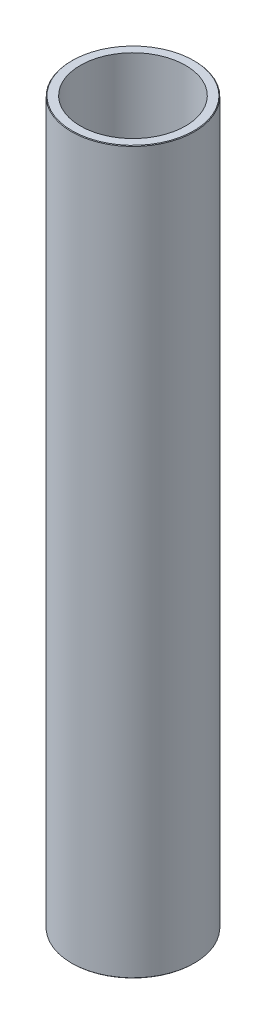
ISO-10303-21;
HEADER;
FILE_DESCRIPTION(('STEP AP214'),'2;1');
FILE_NAME('part.step','',(''),(''),'','','');
FILE_SCHEMA(('AUTOMOTIVE_DESIGN { 1 0 10303 214 1 1 1 1 }'));
ENDSEC;
DATA;
#1=APPLICATION_CONTEXT('core data for automotive mechanical design processes');
#2=APPLICATION_PROTOCOL_DEFINITION('international standard','automotive_design',2000,#1);
#3=PRODUCT_CONTEXT('',#1,'mechanical');
#4=PRODUCT('Part','Part','',(#3));
#5=PRODUCT_RELATED_PRODUCT_CATEGORY('part','',(#4));
#6=PRODUCT_DEFINITION_FORMATION('','',#4);
#7=PRODUCT_DEFINITION_CONTEXT('part definition',#1,'design');
#8=PRODUCT_DEFINITION('design','',#6,#7);
#9=PRODUCT_DEFINITION_SHAPE('','',#8);
#10=(LENGTH_UNIT() NAMED_UNIT(*) SI_UNIT(.MILLI.,.METRE.));
#11=(NAMED_UNIT(*) PLANE_ANGLE_UNIT() SI_UNIT($,.RADIAN.));
#12=(NAMED_UNIT(*) SI_UNIT($,.STERADIAN.) SOLID_ANGLE_UNIT());
#13=UNCERTAINTY_MEASURE_WITH_UNIT(LENGTH_MEASURE(1.E-05),#10,'distance_accuracy_value','');
#14=(GEOMETRIC_REPRESENTATION_CONTEXT(3) GLOBAL_UNCERTAINTY_ASSIGNED_CONTEXT((#13)) GLOBAL_UNIT_ASSIGNED_CONTEXT((#10,
#11,#12)) REPRESENTATION_CONTEXT('',''));
#15=CARTESIAN_POINT('',(0.,0.,0.));
#16=DIRECTION('',(0.,0.,1.));
#17=DIRECTION('',(1.,0.,0.));
#18=AXIS2_PLACEMENT_3D('',#15,#16,#17);
#19=CARTESIAN_POINT('',(0.,587.045592341904,0.));
#20=DIRECTION('',(0.,-1.,0.));
#21=DIRECTION('',(0.,0.,-1.));
#22=AXIS2_PLACEMENT_3D('',#19,#20,#21);
#23=CYLINDRICAL_SURFACE('',#22,50.);
#24=CARTESIAN_POINT('',(0.,586.566908716559,0.));
#25=DIRECTION('',(0.,1.,0.));
#26=DIRECTION('',(0.,0.,1.));
#27=AXIS2_PLACEMENT_3D('',#24,#25,#26);
#28=CIRCLE('',#27,50.);
#29=CARTESIAN_POINT('',(0.,586.566908716559,50.));
#30=VERTEX_POINT('',#29);
#31=EDGE_CURVE('E50',#30,#30,#28,.F.);
#32=ORIENTED_EDGE('',*,*,#31,.T.);
#33=EDGE_LOOP('',(#32));
#34=FACE_BOUND('',#33,.T.);
#35=CARTESIAN_POINT('',(0.,0.478683625344645,0.));
#36=DIRECTION('',(0.,1.,0.));
#37=DIRECTION('',(0.,0.,1.));
#38=AXIS2_PLACEMENT_3D('',#35,#36,#37);
#39=CIRCLE('',#38,50.);
#40=CARTESIAN_POINT('',(0.,0.478683625344645,50.));
#41=VERTEX_POINT('',#40);
#42=EDGE_CURVE('E51',#41,#41,#39,.T.);
#43=ORIENTED_EDGE('',*,*,#42,.T.);
#44=EDGE_LOOP('',(#43));
#45=FACE_BOUND('',#44,.T.);
#46=ADVANCED_FACE('F39',(#34,#45),#23,.T.);
#47=CARTESIAN_POINT('',(0.,587.045592341904,0.));
#48=DIRECTION('',(0.,1.,0.));
#49=DIRECTION('',(0.,0.,1.));
#50=AXIS2_PLACEMENT_3D('',#47,#48,#49);
#51=PLANE('',#50);
#52=CARTESIAN_POINT('',(0.,587.045592341904,0.));
#53=DIRECTION('',(0.,1.,0.));
#54=DIRECTION('',(0.,0.,1.));
#55=AXIS2_PLACEMENT_3D('',#52,#53,#54);
#56=CIRCLE('',#55,49.5213163746552);
#57=CARTESIAN_POINT('',(0.,587.045592341904,49.5213163746552));
#58=VERTEX_POINT('',#57);
#59=EDGE_CURVE('E54',#58,#58,#56,.T.);
#60=ORIENTED_EDGE('',*,*,#59,.T.);
#61=EDGE_LOOP('',(#60));
#62=FACE_BOUND('',#61,.T.);
#63=CARTESIAN_POINT('',(0.,587.045592341904,0.));
#64=DIRECTION('',(0.,1.,0.));
#65=DIRECTION('',(0.,0.,1.));
#66=AXIS2_PLACEMENT_3D('',#63,#64,#65);
#67=CIRCLE('',#66,42.811026432801);
#68=CARTESIAN_POINT('',(0.,587.045592341904,42.811026432801));
#69=VERTEX_POINT('',#68);
#70=EDGE_CURVE('E58',#69,#69,#67,.T.);
#71=ORIENTED_EDGE('',*,*,#70,.F.);
#72=EDGE_LOOP('',(#71));
#73=FACE_BOUND('',#72,.T.);
#74=ADVANCED_FACE('F69',(#62,#73),#51,.T.);
#75=CARTESIAN_POINT('',(0.,0.,0.));
#76=DIRECTION('',(0.,1.,0.));
#77=DIRECTION('',(0.,0.,1.));
#78=AXIS2_PLACEMENT_3D('',#75,#76,#77);
#79=PLANE('',#78);
#80=CARTESIAN_POINT('',(0.,0.,0.));
#81=DIRECTION('',(0.,1.,0.));
#82=DIRECTION('',(0.,0.,1.));
#83=AXIS2_PLACEMENT_3D('',#80,#81,#82);
#84=CIRCLE('',#83,49.5213163746553);
#85=CARTESIAN_POINT('',(0.,0.,49.5213163746553));
#86=VERTEX_POINT('',#85);
#87=EDGE_CURVE('E10',#86,#86,#84,.F.);
#88=ORIENTED_EDGE('',*,*,#87,.T.);
#89=EDGE_LOOP('',(#88));
#90=FACE_BOUND('',#89,.T.);
#91=CARTESIAN_POINT('',(0.,0.,0.));
#92=DIRECTION('',(0.,1.,0.));
#93=DIRECTION('',(0.,0.,1.));
#94=AXIS2_PLACEMENT_3D('',#91,#92,#93);
#95=CIRCLE('',#94,42.811026432801);
#96=CARTESIAN_POINT('',(0.,0.,42.811026432801));
#97=VERTEX_POINT('',#96);
#98=EDGE_CURVE('E63',#97,#97,#95,.T.);
#99=ORIENTED_EDGE('',*,*,#98,.T.);
#100=EDGE_LOOP('',(#99));
#101=FACE_BOUND('',#100,.T.);
#102=ADVANCED_FACE('F75',(#90,#101),#79,.F.);
#103=CARTESIAN_POINT('',(0.,587.045592341904,0.));
#104=DIRECTION('',(0.,-1.,0.));
#105=DIRECTION('',(0.,0.,-1.));
#106=AXIS2_PLACEMENT_3D('',#103,#104,#105);
#107=CYLINDRICAL_SURFACE('',#106,42.811026432801);
#108=ORIENTED_EDGE('',*,*,#70,.T.);
#109=EDGE_LOOP('',(#108));
#110=FACE_BOUND('',#109,.T.);
#111=ORIENTED_EDGE('',*,*,#98,.F.);
#112=EDGE_LOOP('',(#111));
#113=FACE_BOUND('',#112,.T.);
#114=ADVANCED_FACE('F70',(#110,#113),#107,.F.);
#115=CARTESIAN_POINT('',(0.,587.045592341904,0.));
#116=DIRECTION('',(0.,-1.,0.));
#117=DIRECTION('',(0.,0.,-1.));
#118=AXIS2_PLACEMENT_3D('',#115,#116,#117);
#119=CONICAL_SURFACE('',#118,49.5213163746552,0.785398163397463);
#120=ORIENTED_EDGE('',*,*,#31,.F.);
#121=EDGE_LOOP('',(#120));
#122=FACE_BOUND('',#121,.T.);
#123=ORIENTED_EDGE('',*,*,#59,.F.);
#124=EDGE_LOOP('',(#123));
#125=FACE_BOUND('',#124,.T.);
#126=ADVANCED_FACE('F81',(#122,#125),#119,.T.);
#127=CARTESIAN_POINT('',(0.,0.478683625344645,0.));
#128=DIRECTION('',(0.,1.,0.));
#129=DIRECTION('',(0.,0.,1.));
#130=AXIS2_PLACEMENT_3D('',#127,#128,#129);
#131=CONICAL_SURFACE('',#130,50.,0.785398163397456);
#132=ORIENTED_EDGE('',*,*,#87,.F.);
#133=EDGE_LOOP('',(#132));
#134=FACE_BOUND('',#133,.T.);
#135=ORIENTED_EDGE('',*,*,#42,.F.);
#136=EDGE_LOOP('',(#135));
#137=FACE_BOUND('',#136,.T.);
#138=ADVANCED_FACE('F45',(#134,#137),#131,.T.);
#139=CLOSED_SHELL('',(#46,#74,#102,#114,#126,#138));
#140=MANIFOLD_SOLID_BREP('B2',#139);
#141=ADVANCED_BREP_SHAPE_REPRESENTATION('',(#18,#140),#14);
#142=SHAPE_DEFINITION_REPRESENTATION(#9,#141);
ENDSEC;
END-ISO-10303-21;
